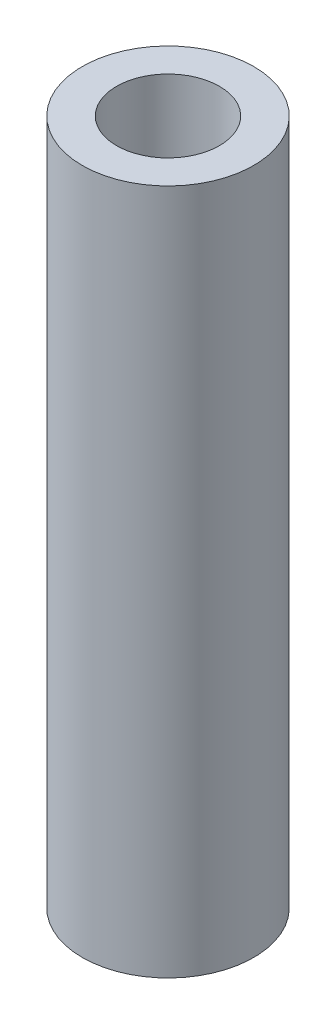
ISO-10303-21;
HEADER;
FILE_DESCRIPTION(('STEP AP214'),'2;1');
FILE_NAME('part.step','',(''),(''),'','','');
FILE_SCHEMA(('AUTOMOTIVE_DESIGN { 1 0 10303 214 1 1 1 1 }'));
ENDSEC;
DATA;
#1=APPLICATION_CONTEXT('core data for automotive mechanical design processes');
#2=APPLICATION_PROTOCOL_DEFINITION('international standard','automotive_design',2000,#1);
#3=PRODUCT_CONTEXT('',#1,'mechanical');
#4=PRODUCT('Part','Part','',(#3));
#5=PRODUCT_RELATED_PRODUCT_CATEGORY('part','',(#4));
#6=PRODUCT_DEFINITION_FORMATION('','',#4);
#7=PRODUCT_DEFINITION_CONTEXT('part definition',#1,'design');
#8=PRODUCT_DEFINITION('design','',#6,#7);
#9=PRODUCT_DEFINITION_SHAPE('','',#8);
#10=(LENGTH_UNIT() NAMED_UNIT(*) SI_UNIT(.MILLI.,.METRE.));
#11=(NAMED_UNIT(*) PLANE_ANGLE_UNIT() SI_UNIT($,.RADIAN.));
#12=(NAMED_UNIT(*) SI_UNIT($,.STERADIAN.) SOLID_ANGLE_UNIT());
#13=UNCERTAINTY_MEASURE_WITH_UNIT(LENGTH_MEASURE(1.E-05),#10,'distance_accuracy_value','');
#14=(GEOMETRIC_REPRESENTATION_CONTEXT(3) GLOBAL_UNCERTAINTY_ASSIGNED_CONTEXT((#13)) GLOBAL_UNIT_ASSIGNED_CONTEXT((#10,
#11,#12)) REPRESENTATION_CONTEXT('',''));
#15=CARTESIAN_POINT('',(0.,0.,0.));
#16=DIRECTION('',(0.,0.,1.));
#17=DIRECTION('',(1.,0.,0.));
#18=AXIS2_PLACEMENT_3D('',#15,#16,#17);
#19=CARTESIAN_POINT('',(0.,20.,0.));
#20=DIRECTION('',(0.,1.,0.));
#21=DIRECTION('',(0.,0.,-1.));
#22=AXIS2_PLACEMENT_3D('',#19,#20,#21);
#23=PLANE('',#22);
#24=CARTESIAN_POINT('',(0.,20.,0.));
#25=DIRECTION('',(0.,-1.,0.));
#26=DIRECTION('',(0.,0.,-1.));
#27=AXIS2_PLACEMENT_3D('',#24,#25,#26);
#28=CIRCLE('',#27,2.5);
#29=CARTESIAN_POINT('',(0.,20.,-2.5));
#30=VERTEX_POINT('',#29);
#31=EDGE_CURVE('E10',#30,#30,#28,.T.);
#32=ORIENTED_EDGE('',*,*,#31,.F.);
#33=EDGE_LOOP('',(#32));
#34=FACE_BOUND('',#33,.T.);
#35=CARTESIAN_POINT('',(0.,20.,0.));
#36=DIRECTION('',(0.,-1.,0.));
#37=DIRECTION('',(0.,0.,-1.));
#38=AXIS2_PLACEMENT_3D('',#35,#36,#37);
#39=CIRCLE('',#38,1.5);
#40=CARTESIAN_POINT('',(0.,20.,-1.5));
#41=VERTEX_POINT('',#40);
#42=EDGE_CURVE('E44',#41,#41,#39,.T.);
#43=ORIENTED_EDGE('',*,*,#42,.T.);
#44=EDGE_LOOP('',(#43));
#45=FACE_BOUND('',#44,.T.);
#46=ADVANCED_FACE('F33',(#34,#45),#23,.T.);
#47=CARTESIAN_POINT('',(0.,0.,0.));
#48=DIRECTION('',(0.,1.,0.));
#49=DIRECTION('',(0.,0.,-1.));
#50=AXIS2_PLACEMENT_3D('',#47,#48,#49);
#51=PLANE('',#50);
#52=CARTESIAN_POINT('',(0.,0.,0.));
#53=DIRECTION('',(0.,-1.,0.));
#54=DIRECTION('',(0.,0.,-1.));
#55=AXIS2_PLACEMENT_3D('',#52,#53,#54);
#56=CIRCLE('',#55,2.5);
#57=CARTESIAN_POINT('',(0.,0.,-2.5));
#58=VERTEX_POINT('',#57);
#59=EDGE_CURVE('E37',#58,#58,#56,.T.);
#60=ORIENTED_EDGE('',*,*,#59,.T.);
#61=EDGE_LOOP('',(#60));
#62=FACE_BOUND('',#61,.T.);
#63=CARTESIAN_POINT('',(0.,0.,0.));
#64=DIRECTION('',(0.,-1.,0.));
#65=DIRECTION('',(0.,0.,-1.));
#66=AXIS2_PLACEMENT_3D('',#63,#64,#65);
#67=CIRCLE('',#66,1.5);
#68=CARTESIAN_POINT('',(0.,0.,-1.5));
#69=VERTEX_POINT('',#68);
#70=EDGE_CURVE('E46',#69,#69,#67,.T.);
#71=ORIENTED_EDGE('',*,*,#70,.F.);
#72=EDGE_LOOP('',(#71));
#73=FACE_BOUND('',#72,.T.);
#74=ADVANCED_FACE('F59',(#62,#73),#51,.F.);
#75=CARTESIAN_POINT('',(0.,20.,0.));
#76=DIRECTION('',(0.,-1.,0.));
#77=DIRECTION('',(0.,0.,1.));
#78=AXIS2_PLACEMENT_3D('',#75,#76,#77);
#79=CYLINDRICAL_SURFACE('',#78,2.5);
#80=ORIENTED_EDGE('',*,*,#31,.T.);
#81=EDGE_LOOP('',(#80));
#82=FACE_BOUND('',#81,.T.);
#83=ORIENTED_EDGE('',*,*,#59,.F.);
#84=EDGE_LOOP('',(#83));
#85=FACE_BOUND('',#84,.T.);
#86=ADVANCED_FACE('F35',(#82,#85),#79,.T.);
#87=CARTESIAN_POINT('',(0.,20.,0.));
#88=DIRECTION('',(0.,-1.,0.));
#89=DIRECTION('',(0.,0.,1.));
#90=AXIS2_PLACEMENT_3D('',#87,#88,#89);
#91=CYLINDRICAL_SURFACE('',#90,1.5);
#92=ORIENTED_EDGE('',*,*,#42,.F.);
#93=EDGE_LOOP('',(#92));
#94=FACE_BOUND('',#93,.T.);
#95=ORIENTED_EDGE('',*,*,#70,.T.);
#96=EDGE_LOOP('',(#95));
#97=FACE_BOUND('',#96,.T.);
#98=ADVANCED_FACE('F53',(#94,#97),#91,.F.);
#99=CLOSED_SHELL('',(#46,#74,#86,#98));
#100=MANIFOLD_SOLID_BREP('B2',#99);
#101=ADVANCED_BREP_SHAPE_REPRESENTATION('',(#18,#100),#14);
#102=SHAPE_DEFINITION_REPRESENTATION(#9,#101);
ENDSEC;
END-ISO-10303-21;
